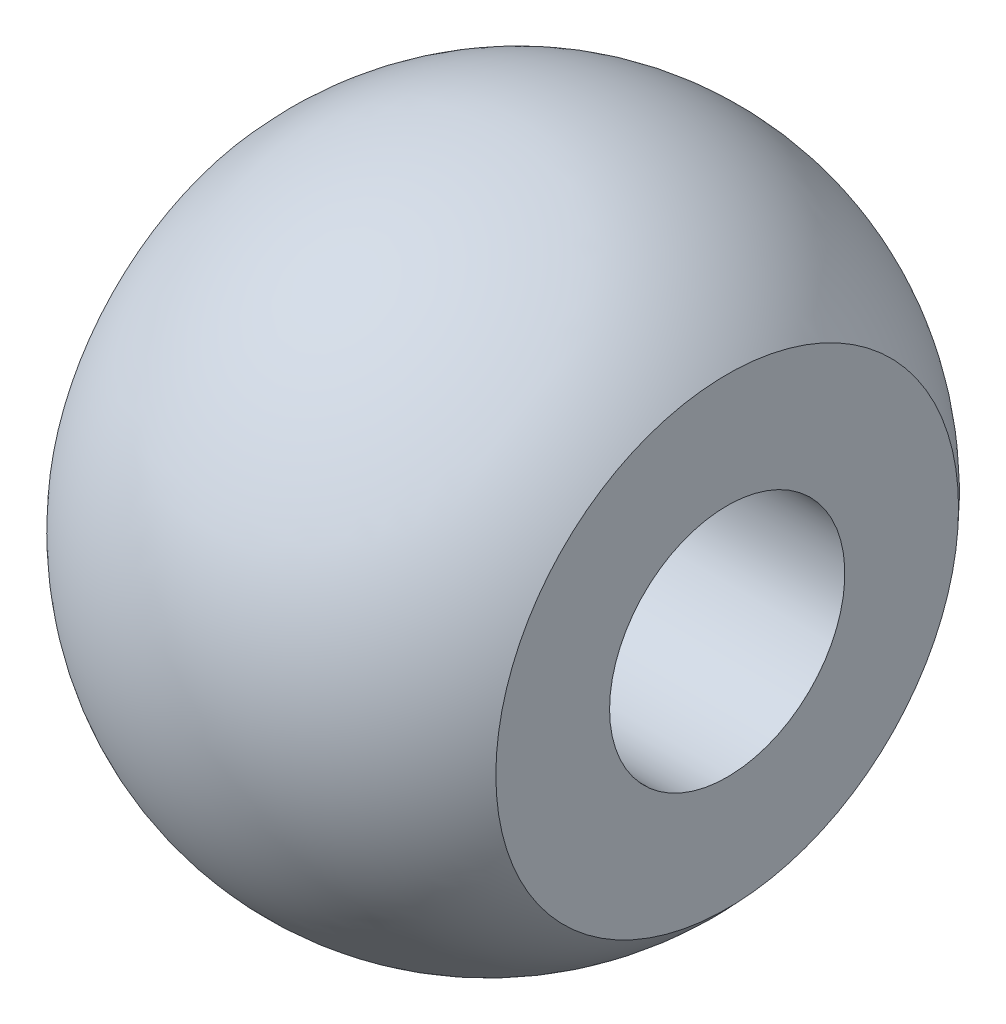
ISO-10303-21;
HEADER;
FILE_DESCRIPTION(('STEP AP214'),'2;1');
FILE_NAME('part.step','',(''),(''),'','','');
FILE_SCHEMA(('AUTOMOTIVE_DESIGN { 1 0 10303 214 1 1 1 1 }'));
ENDSEC;
DATA;
#1=APPLICATION_CONTEXT('core data for automotive mechanical design processes');
#2=APPLICATION_PROTOCOL_DEFINITION('international standard','automotive_design',2000,#1);
#3=PRODUCT_CONTEXT('',#1,'mechanical');
#4=PRODUCT('Part','Part','',(#3));
#5=PRODUCT_RELATED_PRODUCT_CATEGORY('part','',(#4));
#6=PRODUCT_DEFINITION_FORMATION('','',#4);
#7=PRODUCT_DEFINITION_CONTEXT('part definition',#1,'design');
#8=PRODUCT_DEFINITION('design','',#6,#7);
#9=PRODUCT_DEFINITION_SHAPE('','',#8);
#10=(LENGTH_UNIT() NAMED_UNIT(*) SI_UNIT(.MILLI.,.METRE.));
#11=(NAMED_UNIT(*) PLANE_ANGLE_UNIT() SI_UNIT($,.RADIAN.));
#12=(NAMED_UNIT(*) SI_UNIT($,.STERADIAN.) SOLID_ANGLE_UNIT());
#13=UNCERTAINTY_MEASURE_WITH_UNIT(LENGTH_MEASURE(1.E-05),#10,'distance_accuracy_value','');
#14=(GEOMETRIC_REPRESENTATION_CONTEXT(3) GLOBAL_UNCERTAINTY_ASSIGNED_CONTEXT((#13)) GLOBAL_UNIT_ASSIGNED_CONTEXT((#10,
#11,#12)) REPRESENTATION_CONTEXT('',''));
#15=CARTESIAN_POINT('',(0.,0.,0.));
#16=DIRECTION('',(0.,0.,1.));
#17=DIRECTION('',(1.,0.,0.));
#18=AXIS2_PLACEMENT_3D('',#15,#16,#17);
#19=CARTESIAN_POINT('',(-3.08791585178712,0.,0.));
#20=DIRECTION('',(-1.,0.,0.));
#21=DIRECTION('',(0.,0.,1.));
#22=AXIS2_PLACEMENT_3D('',#19,#20,#21);
#23=CONICAL_SURFACE('',#22,3.16576246989939,0.677427256266188);
#24=CARTESIAN_POINT('',(-2.08791585178712,0.,0.));
#25=DIRECTION('',(-1.,0.,0.));
#26=DIRECTION('',(0.,0.,1.));
#27=AXIS2_PLACEMENT_3D('',#24,#25,#26);
#28=CIRCLE('',#27,2.3613474160725);
#29=CARTESIAN_POINT('',(-2.08791585178712,0.,2.3613474160725));
#30=VERTEX_POINT('',#29);
#31=EDGE_CURVE('E50',#30,#30,#28,.T.);
#32=ORIENTED_EDGE('',*,*,#31,.F.);
#33=EDGE_LOOP('',(#32));
#34=FACE_BOUND('',#33,.T.);
#35=CARTESIAN_POINT('',(-3.08791585178712,0.,0.));
#36=DIRECTION('',(-1.,0.,0.));
#37=DIRECTION('',(0.,0.,1.));
#38=AXIS2_PLACEMENT_3D('',#35,#36,#37);
#39=CIRCLE('',#38,3.16576246989939);
#40=CARTESIAN_POINT('',(-3.08791585178712,0.,3.16576246989939));
#41=VERTEX_POINT('',#40);
#42=EDGE_CURVE('E10',#41,#41,#39,.T.);
#43=ORIENTED_EDGE('',*,*,#42,.T.);
#44=EDGE_LOOP('',(#43));
#45=FACE_BOUND('',#44,.T.);
#46=ADVANCED_FACE('F31',(#34,#45),#23,.F.);
#47=CARTESIAN_POINT('',(-3.08791585178712,3.16576246989939,0.));
#48=DIRECTION('',(1.,0.,0.));
#49=DIRECTION('',(0.,0.,-1.));
#50=AXIS2_PLACEMENT_3D('',#47,#48,#49);
#51=PLANE('',#50);
#52=ORIENTED_EDGE('',*,*,#42,.F.);
#53=EDGE_LOOP('',(#52));
#54=FACE_BOUND('',#53,.T.);
#55=CARTESIAN_POINT('',(-3.08791585178712,0.,0.));
#56=DIRECTION('',(-1.,0.,0.));
#57=DIRECTION('',(0.,0.,1.));
#58=AXIS2_PLACEMENT_3D('',#55,#56,#57);
#59=CIRCLE('',#58,4.64484821403271);
#60=CARTESIAN_POINT('',(-3.08791585178712,0.,4.64484821403271));
#61=VERTEX_POINT('',#60);
#62=EDGE_CURVE('E37',#61,#61,#59,.T.);
#63=ORIENTED_EDGE('',*,*,#62,.T.);
#64=EDGE_LOOP('',(#63));
#65=FACE_BOUND('',#64,.T.);
#66=ADVANCED_FACE('F57',(#54,#65),#51,.F.);
#67=CARTESIAN_POINT('',(1.41208414821288,0.,0.));
#68=DIRECTION('',(-1.,0.,0.));
#69=DIRECTION('',(0.,0.,1.));
#70=AXIS2_PLACEMENT_3D('',#67,#68,#69);
#71=DEGENERATE_TOROIDAL_SURFACE('',#70,0.676221247435831,6.,.T.);
#72=ORIENTED_EDGE('',*,*,#62,.F.);
#73=EDGE_LOOP('',(#72));
#74=FACE_BOUND('',#73,.T.);
#75=CARTESIAN_POINT('',(5.91208414821288,0.,0.));
#76=DIRECTION('',(-1.,0.,0.));
#77=DIRECTION('',(0.,0.,1.));
#78=AXIS2_PLACEMENT_3D('',#75,#76,#77);
#79=CIRCLE('',#78,4.64484821403271);
#80=CARTESIAN_POINT('',(5.91208414821288,0.,4.64484821403271));
#81=VERTEX_POINT('',#80);
#82=EDGE_CURVE('E41',#81,#81,#79,.T.);
#83=ORIENTED_EDGE('',*,*,#82,.T.);
#84=EDGE_LOOP('',(#83));
#85=FACE_BOUND('',#84,.T.);
#86=ADVANCED_FACE('F61',(#74,#85),#71,.T.);
#87=CARTESIAN_POINT('',(5.91208414821288,2.3613474160725,0.));
#88=DIRECTION('',(-1.,0.,0.));
#89=DIRECTION('',(0.,0.,1.));
#90=AXIS2_PLACEMENT_3D('',#87,#88,#89);
#91=PLANE('',#90);
#92=ORIENTED_EDGE('',*,*,#82,.F.);
#93=EDGE_LOOP('',(#92));
#94=FACE_BOUND('',#93,.T.);
#95=CARTESIAN_POINT('',(5.91208414821288,0.,0.));
#96=DIRECTION('',(-1.,0.,0.));
#97=DIRECTION('',(0.,0.,1.));
#98=AXIS2_PLACEMENT_3D('',#95,#96,#97);
#99=CIRCLE('',#98,2.3613474160725);
#100=CARTESIAN_POINT('',(5.91208414821288,0.,2.3613474160725));
#101=VERTEX_POINT('',#100);
#102=EDGE_CURVE('E45',#101,#101,#99,.T.);
#103=ORIENTED_EDGE('',*,*,#102,.T.);
#104=EDGE_LOOP('',(#103));
#105=FACE_BOUND('',#104,.T.);
#106=ADVANCED_FACE('F66',(#94,#105),#91,.F.);
#107=CARTESIAN_POINT('',(-2.80247825204209,0.,0.));
#108=DIRECTION('',(-1.,0.,0.));
#109=DIRECTION('',(0.,0.,1.));
#110=AXIS2_PLACEMENT_3D('',#107,#108,#109);
#111=CYLINDRICAL_SURFACE('',#110,2.3613474160725);
#112=ORIENTED_EDGE('',*,*,#102,.F.);
#113=EDGE_LOOP('',(#112));
#114=FACE_BOUND('',#113,.T.);
#115=ORIENTED_EDGE('',*,*,#31,.T.);
#116=EDGE_LOOP('',(#115));
#117=FACE_BOUND('',#116,.T.);
#118=ADVANCED_FACE('F54',(#114,#117),#111,.F.);
#119=CLOSED_SHELL('',(#46,#66,#86,#106,#118));
#120=MANIFOLD_SOLID_BREP('B2',#119);
#121=ADVANCED_BREP_SHAPE_REPRESENTATION('',(#18,#120),#14);
#122=SHAPE_DEFINITION_REPRESENTATION(#9,#121);
ENDSEC;
END-ISO-10303-21;
